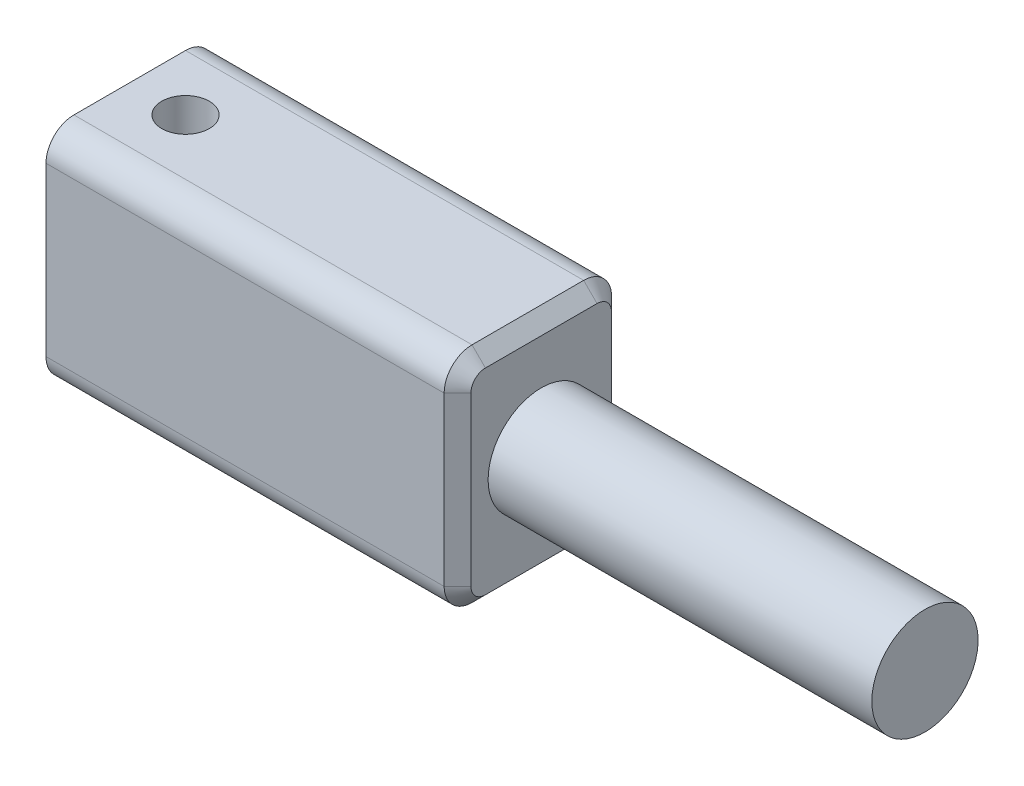
ISO-10303-21;
HEADER;
FILE_DESCRIPTION(('STEP AP214'),'2;1');
FILE_NAME('part.step','',(''),(''),'','','');
FILE_SCHEMA(('AUTOMOTIVE_DESIGN { 1 0 10303 214 1 1 1 1 }'));
ENDSEC;
DATA;
#1=APPLICATION_CONTEXT('core data for automotive mechanical design processes');
#2=APPLICATION_PROTOCOL_DEFINITION('international standard','automotive_design',2000,#1);
#3=PRODUCT_CONTEXT('',#1,'mechanical');
#4=PRODUCT('Part','Part','',(#3));
#5=PRODUCT_RELATED_PRODUCT_CATEGORY('part','',(#4));
#6=PRODUCT_DEFINITION_FORMATION('','',#4);
#7=PRODUCT_DEFINITION_CONTEXT('part definition',#1,'design');
#8=PRODUCT_DEFINITION('design','',#6,#7);
#9=PRODUCT_DEFINITION_SHAPE('','',#8);
#10=(LENGTH_UNIT() NAMED_UNIT(*) SI_UNIT(.MILLI.,.METRE.));
#11=(NAMED_UNIT(*) PLANE_ANGLE_UNIT() SI_UNIT($,.RADIAN.));
#12=(NAMED_UNIT(*) SI_UNIT($,.STERADIAN.) SOLID_ANGLE_UNIT());
#13=UNCERTAINTY_MEASURE_WITH_UNIT(LENGTH_MEASURE(1.E-05),#10,'distance_accuracy_value','');
#14=(GEOMETRIC_REPRESENTATION_CONTEXT(3) GLOBAL_UNCERTAINTY_ASSIGNED_CONTEXT((#13)) GLOBAL_UNIT_ASSIGNED_CONTEXT((#10,
#11,#12)) REPRESENTATION_CONTEXT('',''));
#15=CARTESIAN_POINT('',(0.,0.,0.));
#16=DIRECTION('',(0.,0.,1.));
#17=DIRECTION('',(1.,0.,0.));
#18=AXIS2_PLACEMENT_3D('',#15,#16,#17);
#19=CARTESIAN_POINT('',(39.28745,6.35,-4.7625));
#20=DIRECTION('',(0.,1.,0.));
#21=DIRECTION('',(0.,0.,1.));
#22=AXIS2_PLACEMENT_3D('',#19,#20,#21);
#23=PLANE('',#22);
#24=DIRECTION('',(-1.,0.,0.));
#25=VECTOR('',#24,1.);
#26=CARTESIAN_POINT('',(39.28745,6.35,3.175));
#27=LINE('',#26,#25);
#28=CARTESIAN_POINT('',(0.,6.35,3.175));
#29=VERTEX_POINT('',#28);
#30=CARTESIAN_POINT('',(22.65045,6.35,3.175));
#31=VERTEX_POINT('',#30);
#32=EDGE_CURVE('E491',#29,#31,#27,.F.);
#33=ORIENTED_EDGE('',*,*,#32,.T.);
#34=DIRECTION('',(0.,0.,-1.));
#35=VECTOR('',#34,1.);
#36=CARTESIAN_POINT('',(22.65045,6.35,-3.175));
#37=LINE('',#36,#35);
#38=CARTESIAN_POINT('',(22.65045,6.35,-3.175));
#39=VERTEX_POINT('',#38);
#40=EDGE_CURVE('E12',#31,#39,#37,.T.);
#41=ORIENTED_EDGE('',*,*,#40,.T.);
#42=DIRECTION('',(-1.,0.,0.));
#43=VECTOR('',#42,1.);
#44=CARTESIAN_POINT('',(39.28745,6.35,-3.175));
#45=LINE('',#44,#43);
#46=CARTESIAN_POINT('',(0.,6.35,-3.175));
#47=VERTEX_POINT('',#46);
#48=EDGE_CURVE('E493',#39,#47,#45,.T.);
#49=ORIENTED_EDGE('',*,*,#48,.T.);
#50=DIRECTION('',(0.,0.,-1.));
#51=VECTOR('',#50,1.);
#52=CARTESIAN_POINT('',(0.,6.35,-4.7625));
#53=LINE('',#52,#51);
#54=EDGE_CURVE('E454',#29,#47,#53,.T.);
#55=ORIENTED_EDGE('',*,*,#54,.F.);
#56=EDGE_LOOP('',(#33,#41,#49,#55));
#57=FACE_BOUND('',#56,.T.);
#58=CARTESIAN_POINT('',(3.175,6.35,0.));
#59=DIRECTION('',(0.,1.,0.));
#60=DIRECTION('',(0.,0.,1.));
#61=AXIS2_PLACEMENT_3D('',#58,#59,#60);
#62=CIRCLE('',#61,1.35255);
#63=CARTESIAN_POINT('',(3.175,6.35,1.35255));
#64=VERTEX_POINT('',#63);
#65=EDGE_CURVE('E568',#64,#64,#62,.T.);
#66=ORIENTED_EDGE('',*,*,#65,.F.);
#67=EDGE_LOOP('',(#66));
#68=FACE_BOUND('',#67,.T.);
#69=ADVANCED_FACE('F361',(#57,#68),#23,.T.);
#70=CARTESIAN_POINT('',(9.525,0.,0.));
#71=DIRECTION('',(-1.,0.,0.));
#72=DIRECTION('',(0.,0.,1.));
#73=AXIS2_PLACEMENT_3D('',#70,#71,#72);
#74=CYLINDRICAL_SURFACE('',#73,1.524);
#75=CARTESIAN_POINT('',(0.,0.,0.));
#76=DIRECTION('',(-1.,0.,0.));
#77=DIRECTION('',(0.,0.,1.));
#78=AXIS2_PLACEMENT_3D('',#75,#76,#77);
#79=CIRCLE('',#78,1.524);
#80=CARTESIAN_POINT('',(0.,0.,1.524));
#81=VERTEX_POINT('',#80);
#82=EDGE_CURVE('E663',#81,#81,#79,.T.);
#83=ORIENTED_EDGE('',*,*,#82,.T.);
#84=EDGE_LOOP('',(#83));
#85=FACE_BOUND('',#84,.T.);
#86=CARTESIAN_POINT('',(9.525,0.,0.));
#87=DIRECTION('',(-1.,0.,0.));
#88=DIRECTION('',(0.,0.,1.));
#89=AXIS2_PLACEMENT_3D('',#86,#87,#88);
#90=CIRCLE('',#89,1.524);
#91=CARTESIAN_POINT('',(9.525,0.,1.524));
#92=VERTEX_POINT('',#91);
#93=EDGE_CURVE('E469',#92,#92,#90,.T.);
#94=ORIENTED_EDGE('',*,*,#93,.F.);
#95=EDGE_LOOP('',(#94));
#96=FACE_BOUND('',#95,.T.);
#97=CARTESIAN_POINT('',(3.175,-0.702270957323452,1.35255));
#98=CARTESIAN_POINT('',(3.21707217968336,-0.702279979262497,1.35254717818324));
#99=CARTESIAN_POINT('',(3.2591643143721,-0.706141236265535,1.35056087661199));
#100=CARTESIAN_POINT('',(3.34184693441425,-0.720653947836462,1.3428680638871));
#101=CARTESIAN_POINT('',(3.38243196712902,-0.731327915477317,1.3371492168582));
#102=CARTESIAN_POINT('',(3.47957631490848,-0.763523860000407,1.31911937089296));
#103=CARTESIAN_POINT('',(3.53485012558653,-0.787779459464968,1.30498326977875));
#104=CARTESIAN_POINT('',(3.64094442790641,-0.841537752527547,1.27098829114154));
#105=CARTESIAN_POINT('',(3.69174649367795,-0.871060765628537,1.25110706036587));
#106=CARTESIAN_POINT('',(3.78085338917612,-0.926970786373431,1.21007746320126));
#107=CARTESIAN_POINT('',(3.81978213869841,-0.952992605080561,1.18977093749453));
#108=CARTESIAN_POINT('',(3.89523306169008,-1.00557944964072,1.14567324245321));
#109=CARTESIAN_POINT('',(3.93175381464058,-1.03214478422859,1.12188004246961));
#110=CARTESIAN_POINT('',(4.03772218242477,-1.11141960629747,1.04532115075714));
#111=CARTESIAN_POINT('',(4.10375714327414,-1.16382979548051,0.987292210958925));
#112=CARTESIAN_POINT('',(4.21080906979762,-1.2511587498098,0.872411103540684));
#113=CARTESIAN_POINT('',(4.25404882712305,-1.28728225322205,0.818528346752338));
#114=CARTESIAN_POINT('',(4.33294448831643,-1.35409562655333,0.702467042033983));
#115=CARTESIAN_POINT('',(4.36861337122796,-1.38479478025334,0.640302993841241));
#116=CARTESIAN_POINT('',(4.42456600797019,-1.43333461068743,0.521004660290256));
#117=CARTESIAN_POINT('',(4.44648803820053,-1.45251193129574,0.465187769180202));
#118=CARTESIAN_POINT('',(4.48302451531313,-1.48459940546605,0.349478423927672));
#119=CARTESIAN_POINT('',(4.4976433200318,-1.49751329628366,0.289588424509329));
#120=CARTESIAN_POINT('',(4.51866145662187,-1.5161089677639,0.166903556635082));
#121=CARTESIAN_POINT('',(4.52501436302095,-1.52174989820533,0.104094315594963));
#122=CARTESIAN_POINT('',(4.52883977769142,-1.52514445578943,-0.0220041355046523));
#123=CARTESIAN_POINT('',(4.52631460610187,-1.52290014361013,-0.0852932158525667));
#124=CARTESIAN_POINT('',(4.51323018247251,-1.51130303702087,-0.204441240571813));
#125=CARTESIAN_POINT('',(4.5034229544322,-1.50261571002647,-0.260452224794975));
#126=CARTESIAN_POINT('',(4.47726068872912,-1.47953693873412,-0.369682348683285));
#127=CARTESIAN_POINT('',(4.46090401488295,-1.46514406908574,-0.422900786953862));
#128=CARTESIAN_POINT('',(4.4212725144013,-1.43048290746596,-0.528760852731155));
#129=CARTESIAN_POINT('',(4.39763164437999,-1.40990567138485,-0.581162156614216));
#130=CARTESIAN_POINT('',(4.34491879370703,-1.36444751224133,-0.681085210018799));
#131=CARTESIAN_POINT('',(4.31584569876128,-1.33956570627468,-0.728605955302902));
#132=CARTESIAN_POINT('',(4.23676721794219,-1.27274377861347,-0.842025451480227));
#133=CARTESIAN_POINT('',(4.18375404315887,-1.22867618797298,-0.904579116775021));
#134=CARTESIAN_POINT('',(4.06909452295249,-1.13639682691843,-1.0181100655927));
#135=CARTESIAN_POINT('',(4.00740910463329,-1.0881667045469,-1.06903205444617));
#136=CARTESIAN_POINT('',(3.90832153448637,-1.01510729575818,-1.13722597152992));
#137=CARTESIAN_POINT('',(3.87375220166363,-0.990339529947954,-1.15879547172421));
#138=CARTESIAN_POINT('',(3.80244417231138,-0.941378567028568,-1.19890874898346));
#139=CARTESIAN_POINT('',(3.76570380499716,-0.917185833068511,-1.21745015327655));
#140=CARTESIAN_POINT('',(3.69008436595362,-0.870411845890656,-1.25131443016785));
#141=CARTESIAN_POINT('',(3.65121752518315,-0.847822804532961,-1.26665367715588));
#142=CARTESIAN_POINT('',(3.57090820653243,-0.805459169212386,-1.2940030210235));
#143=CARTESIAN_POINT('',(3.52947082334065,-0.785679248590163,-1.30601946074904));
#144=CARTESIAN_POINT('',(3.45022121831267,-0.75354551810751,-1.32477883385933));
#145=CARTESIAN_POINT('',(3.41281487347676,-0.740520008441139,-1.33204562784078));
#146=CARTESIAN_POINT('',(3.33619456686584,-0.719598636268923,-1.34346507565195));
#147=CARTESIAN_POINT('',(3.2969870537631,-0.711685800898481,-1.34762804061677));
#148=CARTESIAN_POINT('',(3.21710797519513,-0.702409401308774,-1.35249026637018));
#149=CARTESIAN_POINT('',(3.17642523200408,-0.701116833495169,-1.35315198189233));
#150=CARTESIAN_POINT('',(3.09553088696961,-0.705591670023033,-1.35082197843788));
#151=CARTESIAN_POINT('',(3.0553200575734,-0.71136935906665,-1.34782493729041));
#152=CARTESIAN_POINT('',(2.96792599485148,-0.730653206610229,-1.33748273346956));
#153=CARTESIAN_POINT('',(2.92117236186777,-0.745588304634533,-1.32932118208931));
#154=CARTESIAN_POINT('',(2.83073217898877,-0.780994820452487,-1.30883118995821));
#155=CARTESIAN_POINT('',(2.78705800023929,-0.801487125720679,-1.29648698358507));
#156=CARTESIAN_POINT('',(2.70657947746851,-0.843530277280837,-1.26948792522576));
#157=CARTESIAN_POINT('',(2.66951485821868,-0.864802087293333,-1.25515789758804));
#158=CARTESIAN_POINT('',(2.59748189898453,-0.908791447443696,-1.22368658903565));
#159=CARTESIAN_POINT('',(2.56251517718985,-0.931510086426917,-1.20654317516912));
#160=CARTESIAN_POINT('',(2.46039851996664,-1.00064820268408,-1.15098258898917));
#161=CARTESIAN_POINT('',(2.39608199798879,-1.04802113948181,-1.1084522840693));
#162=CARTESIAN_POINT('',(2.27070372804145,-1.14422575019542,-1.0091837203809));
#163=CARTESIAN_POINT('',(2.21015767539551,-1.19293882226644,-0.951678112407259));
#164=CARTESIAN_POINT('',(2.09902154373213,-1.28449682649553,-0.823882868449129));
#165=CARTESIAN_POINT('',(2.04840177038203,-1.32735914047292,-0.753632610525875));
#166=CARTESIAN_POINT('',(1.97407854020015,-1.39110139465381,-0.625138330755869));
#167=CARTESIAN_POINT('',(1.94693733014504,-1.41463456160875,-0.570197342077547));
#168=CARTESIAN_POINT('',(1.89983630684233,-1.45571040309329,-0.455192241264111));
#169=CARTESIAN_POINT('',(1.87987167295367,-1.47325709844374,-0.395131601769294));
#170=CARTESIAN_POINT('',(1.84825012351509,-1.50113078852859,-0.270691843317126));
#171=CARTESIAN_POINT('',(1.83665787260538,-1.51140157591453,-0.206283225701143));
#172=CARTESIAN_POINT('',(1.82297811137812,-1.52352783509803,-0.0756874888437563));
#173=CARTESIAN_POINT('',(1.82088452196937,-1.52538868920375,-0.00950153438310301));
#174=CARTESIAN_POINT('',(1.8260402528428,-1.52081442502809,0.114416735355444));
#175=CARTESIAN_POINT('',(1.83222731326676,-1.51532250764779,0.172233851767758));
#176=CARTESIAN_POINT('',(1.85171165075638,-1.4980841090639,0.285679418145234));
#177=CARTESIAN_POINT('',(1.86500979574868,-1.48633686438186,0.341307600055206));
#178=CARTESIAN_POINT('',(1.89819349259866,-1.45717382833434,0.44992535727258));
#179=CARTESIAN_POINT('',(1.91817426416168,-1.43967616673655,0.502863253682306));
#180=CARTESIAN_POINT('',(1.96372547923972,-1.40008735638288,0.604406875098513));
#181=CARTESIAN_POINT('',(1.98929839165491,-1.37799417894228,0.653010673238715));
#182=CARTESIAN_POINT('',(2.05865277909166,-1.31869140295251,0.76784024535857));
#183=CARTESIAN_POINT('',(2.10526627176798,-1.27933163768512,0.831252992794772));
#184=CARTESIAN_POINT('',(2.20672301106169,-1.19578970513987,0.94753267865525));
#185=CARTESIAN_POINT('',(2.26158852232377,-1.15159458238565,1.00037015658202));
#186=CARTESIAN_POINT('',(2.3796383931867,-1.06033696777279,1.0966905635919));
#187=CARTESIAN_POINT('',(2.44297795272761,-1.01323298272958,1.139944603812));
#188=CARTESIAN_POINT('',(2.54349555096642,-0.944142696962623,1.19668945693576));
#189=CARTESIAN_POINT('',(2.57790705707033,-0.921380886359577,1.21424387045927));
#190=CARTESIAN_POINT('',(2.64876636319789,-0.87711865651036,1.24659001415373));
#191=CARTESIAN_POINT('',(2.68521266158619,-0.855617330460224,1.26138374753475));
#192=CARTESIAN_POINT('',(2.76272124728248,-0.813651054483193,1.28888076750124));
#193=CARTESIAN_POINT('',(2.80392956253207,-0.793330991337368,1.30139972257987));
#194=CARTESIAN_POINT('',(2.88917980052923,-0.757231243757115,1.32273075371325));
#195=CARTESIAN_POINT('',(2.93321346873306,-0.741439009371421,1.33155310775882));
#196=CARTESIAN_POINT('',(3.01037129337357,-0.720661433028069,1.34287789414377));
#197=CARTESIAN_POINT('',(3.04283129557991,-0.713857614010815,1.34648053559675));
#198=CARTESIAN_POINT('',(3.10852414729912,-0.704661911686318,1.35131603825143));
#199=CARTESIAN_POINT('',(3.14175584401672,-0.702263828461787,1.35255222971372));
#200=CARTESIAN_POINT('',(3.175,-0.702270957323452,1.35255));
#201=B_SPLINE_CURVE_WITH_KNOTS('',3,(#97,#98,#99,#100,#101,#102,#103,#104,#105,#106,#107,#108,
#109,#110,#111,#112,#113,#114,#115,#116,#117,#118,#119,#120,#121,#122,#123,#124,#125,#126,#127,
#128,#129,#130,#131,#132,#133,#134,#135,#136,#137,#138,#139,#140,#141,#142,#143,#144,#145,#146,
#147,#148,#149,#150,#151,#152,#153,#154,#155,#156,#157,#158,#159,#160,#161,#162,#163,#164,#165,
#166,#167,#168,#169,#170,#171,#172,#173,#174,#175,#176,#177,#178,#179,#180,#181,#182,#183,#184,
#185,#186,#187,#188,#189,#190,#191,#192,#193,#194,#195,#196,#197,#198,#199,#200),.UNSPECIFIED.,
.T.,.F.,(4,2,2,2,2,2,2,2,2,2,2,2,2,2,2,2,2,2,2,2,2,2,2,2,2,2,2,2,2,2,2,2,2,2,2,2,2,2,2,2,2,2,2,
2,2,2,2,2,2,2,2,4),(0.,0.126063369193998,0.252545495709718,0.437479934952307,0.623143838396348,
0.776063927680587,0.929073434650462,1.23439828791887,1.46749024436466,1.70017931576062,
1.88829730084201,2.07630290140219,2.26535994238806,2.45436758011159,2.62617526171937,
2.79802589114982,2.98053101244574,3.16307361158685,3.44084358107695,3.71990773794989,
3.86284266811253,4.00588906812932,4.14818503530543,4.29020747117032,4.41064990338174,
4.53069041254542,4.65201559213964,4.77351746658282,4.92194493525667,5.07093821082692,
5.20597279661751,5.34111023507301,5.61156354361266,5.90033933011229,6.18823760822231,
6.38443434883885,6.58049905305646,6.77806233685239,6.97549916337932,7.14988497386687,
7.32429207346217,7.50129839279643,7.67838301781703,7.94091316310625,8.20416478347162,
8.47315188413674,8.60755574743725,8.74186170186414,8.88442113164787,9.02658151740235,
9.12633343769168,9.22594487548273),.UNSPECIFIED.);
#202=CARTESIAN_POINT('',(3.175,-0.702270957323452,1.35255));
#203=VERTEX_POINT('',#202);
#204=EDGE_CURVE('E666',#203,#203,#201,.T.);
#205=ORIENTED_EDGE('',*,*,#204,.F.);
#206=EDGE_LOOP('',(#205));
#207=FACE_BOUND('',#206,.T.);
#208=CARTESIAN_POINT('',(3.175,0.702270957323452,-1.35255));
#209=CARTESIAN_POINT('',(3.13292782031664,0.702279979262497,-1.35254717818324));
#210=CARTESIAN_POINT('',(3.09083568562791,0.706141236265535,-1.35056087661199));
#211=CARTESIAN_POINT('',(3.00815306558575,0.720653947836462,-1.3428680638871));
#212=CARTESIAN_POINT('',(2.96756803287098,0.731327915477317,-1.3371492168582));
#213=CARTESIAN_POINT('',(2.87042368509153,0.763523860000406,-1.31911937089296));
#214=CARTESIAN_POINT('',(2.81514987441348,0.787779459464967,-1.30498326977875));
#215=CARTESIAN_POINT('',(2.70905557209359,0.841537752527545,-1.27098829114155));
#216=CARTESIAN_POINT('',(2.65825350632205,0.871060765628536,-1.25110706036587));
#217=CARTESIAN_POINT('',(2.56914661082389,0.926970786373429,-1.21007746320126));
#218=CARTESIAN_POINT('',(2.5302178613016,0.952992605080559,-1.18977093749453));
#219=CARTESIAN_POINT('',(2.45476693830992,1.00557944964072,-1.14567324245321));
#220=CARTESIAN_POINT('',(2.41824618535943,1.03214478422859,-1.12188004246961));
#221=CARTESIAN_POINT('',(2.31227781757523,1.11141960629746,-1.04532115075715));
#222=CARTESIAN_POINT('',(2.24624285672587,1.1638297954805,-0.987292210958928));
#223=CARTESIAN_POINT('',(2.13919093020239,1.25115874980979,-0.872411103540687));
#224=CARTESIAN_POINT('',(2.09595117287696,1.28728225322204,-0.818528346752341));
#225=CARTESIAN_POINT('',(2.01705551168357,1.35409562655333,-0.702467042033986));
#226=CARTESIAN_POINT('',(1.98138662877205,1.38479478025334,-0.640302993841243));
#227=CARTESIAN_POINT('',(1.92543399202981,1.43333461068743,-0.521004660290258));
#228=CARTESIAN_POINT('',(1.90351196179947,1.45251193129574,-0.465187769180204));
#229=CARTESIAN_POINT('',(1.86697548468687,1.48459940546604,-0.349478423927675));
#230=CARTESIAN_POINT('',(1.8523566799682,1.49751329628366,-0.289588424509331));
#231=CARTESIAN_POINT('',(1.83133854337813,1.5161089677639,-0.166903556635084));
#232=CARTESIAN_POINT('',(1.82498563697905,1.52174989820533,-0.104094315594965));
#233=CARTESIAN_POINT('',(1.82116022230858,1.52514445578943,0.0220041355046508));
#234=CARTESIAN_POINT('',(1.82368539389813,1.52290014361013,0.0852932158525652));
#235=CARTESIAN_POINT('',(1.83676981752749,1.51130303702087,0.204441240571811));
#236=CARTESIAN_POINT('',(1.8465770455678,1.50261571002648,0.260452224794973));
#237=CARTESIAN_POINT('',(1.87273931127088,1.47953693873412,0.369682348683283));
#238=CARTESIAN_POINT('',(1.88909598511706,1.46514406908574,0.422900786953861));
#239=CARTESIAN_POINT('',(1.9287274855987,1.43048290746596,0.528760852731154));
#240=CARTESIAN_POINT('',(1.95236835562001,1.40990567138485,0.581162156614215));
#241=CARTESIAN_POINT('',(2.00508120629297,1.36444751224134,0.681085210018798));
#242=CARTESIAN_POINT('',(2.03415430123872,1.33956570627468,0.728605955302901));
#243=CARTESIAN_POINT('',(2.11323278205781,1.27274377861347,0.842025451480226));
#244=CARTESIAN_POINT('',(2.16624595684113,1.22867618797298,0.90457911677502));
#245=CARTESIAN_POINT('',(2.28090547704751,1.13639682691844,1.0181100655927));
#246=CARTESIAN_POINT('',(2.34259089536671,1.0881667045469,1.06903205444617));
#247=CARTESIAN_POINT('',(2.44167846551363,1.01510729575818,1.13722597152992));
#248=CARTESIAN_POINT('',(2.47624779833637,0.990339529947954,1.15879547172421));
#249=CARTESIAN_POINT('',(2.54755582768862,0.941378567028568,1.19890874898346));
#250=CARTESIAN_POINT('',(2.58429619500284,0.917185833068512,1.21745015327655));
#251=CARTESIAN_POINT('',(2.65991563404638,0.870411845890657,1.25131443016785));
#252=CARTESIAN_POINT('',(2.69878247481685,0.847822804532962,1.26665367715588));
#253=CARTESIAN_POINT('',(2.77909179346757,0.805459169212386,1.29400302102349));
#254=CARTESIAN_POINT('',(2.82052917665935,0.785679248590163,1.30601946074904));
#255=CARTESIAN_POINT('',(2.89977878168733,0.75354551810751,1.32477883385933));
#256=CARTESIAN_POINT('',(2.93718512652324,0.74052000844114,1.33204562784078));
#257=CARTESIAN_POINT('',(3.01380543313416,0.719598636268924,1.34346507565195));
#258=CARTESIAN_POINT('',(3.0530129462369,0.711685800898481,1.34762804061677));
#259=CARTESIAN_POINT('',(3.13289202480486,0.702409401308774,1.35249026637018));
#260=CARTESIAN_POINT('',(3.17357476799592,0.701116833495169,1.35315198189233));
#261=CARTESIAN_POINT('',(3.25446911303039,0.705591670023033,1.35082197843788));
#262=CARTESIAN_POINT('',(3.2946799424266,0.711369359066649,1.34782493729041));
#263=CARTESIAN_POINT('',(3.38207400514852,0.730653206610228,1.33748273346957));
#264=CARTESIAN_POINT('',(3.42882763813223,0.745588304634532,1.32932118208931));
#265=CARTESIAN_POINT('',(3.51926782101123,0.780994820452486,1.30883118995821));
#266=CARTESIAN_POINT('',(3.56294199976071,0.801487125720678,1.29648698358507));
#267=CARTESIAN_POINT('',(3.64342052253149,0.843530277280835,1.26948792522577));
#268=CARTESIAN_POINT('',(3.68048514178132,0.864802087293331,1.25515789758804));
#269=CARTESIAN_POINT('',(3.75251810101547,0.908791447443695,1.22368658903565));
#270=CARTESIAN_POINT('',(3.78748482281015,0.931510086426917,1.20654317516912));
#271=CARTESIAN_POINT('',(3.88960148003336,1.00064820268408,1.15098258898917));
#272=CARTESIAN_POINT('',(3.95391800201121,1.04802113948181,1.1084522840693));
#273=CARTESIAN_POINT('',(4.07929627195855,1.14422575019542,1.0091837203809));
#274=CARTESIAN_POINT('',(4.13984232460449,1.19293882226644,0.951678112407258));
#275=CARTESIAN_POINT('',(4.25097845626788,1.28449682649553,0.823882868449127));
#276=CARTESIAN_POINT('',(4.30159822961797,1.32735914047292,0.753632610525872));
#277=CARTESIAN_POINT('',(4.37592145979985,1.39110139465382,0.625138330755867));
#278=CARTESIAN_POINT('',(4.40306266985496,1.41463456160875,0.570197342077545));
#279=CARTESIAN_POINT('',(4.45016369315767,1.4557104030933,0.455192241264108));
#280=CARTESIAN_POINT('',(4.47012832704634,1.47325709844374,0.395131601769292));
#281=CARTESIAN_POINT('',(4.50174987648491,1.50113078852859,0.270691843317123));
#282=CARTESIAN_POINT('',(4.51334212739462,1.51140157591453,0.206283225701141));
#283=CARTESIAN_POINT('',(4.52702188862188,1.52352783509803,0.0756874888437545));
#284=CARTESIAN_POINT('',(4.52911547803063,1.52538868920375,0.00950153438310112));
#285=CARTESIAN_POINT('',(4.5239597471572,1.52081442502809,-0.114416735355446));
#286=CARTESIAN_POINT('',(4.51777268673324,1.51532250764779,-0.17223385176776));
#287=CARTESIAN_POINT('',(4.49828834924362,1.4980841090639,-0.285679418145236));
#288=CARTESIAN_POINT('',(4.48499020425132,1.48633686438186,-0.341307600055208));
#289=CARTESIAN_POINT('',(4.45180650740135,1.45717382833434,-0.449925357272581));
#290=CARTESIAN_POINT('',(4.43182573583832,1.43967616673655,-0.502863253682307));
#291=CARTESIAN_POINT('',(4.38627452076028,1.40008735638288,-0.604406875098515));
#292=CARTESIAN_POINT('',(4.36070160834509,1.37799417894228,-0.653010673238716));
#293=CARTESIAN_POINT('',(4.29134722090834,1.31869140295251,-0.76784024535857));
#294=CARTESIAN_POINT('',(4.24473372823202,1.27933163768512,-0.831252992794773));
#295=CARTESIAN_POINT('',(4.14327698893831,1.19578970513987,-0.947532678655251));
#296=CARTESIAN_POINT('',(4.08841147767623,1.15159458238565,-1.00037015658202));
#297=CARTESIAN_POINT('',(3.9703616068133,1.06033696777279,-1.0966905635919));
#298=CARTESIAN_POINT('',(3.90702204727239,1.01323298272958,-1.139944603812));
#299=CARTESIAN_POINT('',(3.80650444903359,0.944142696962624,-1.19668945693576));
#300=CARTESIAN_POINT('',(3.77209294292968,0.921380886359578,-1.21424387045927));
#301=CARTESIAN_POINT('',(3.70123363680212,0.87711865651036,-1.24659001415372));
#302=CARTESIAN_POINT('',(3.66478733841381,0.855617330460224,-1.26138374753475));
#303=CARTESIAN_POINT('',(3.58727875271752,0.813651054483192,-1.28888076750124));
#304=CARTESIAN_POINT('',(3.54607043746793,0.793330991337368,-1.30139972257987));
#305=CARTESIAN_POINT('',(3.46082019947077,0.757231243757114,-1.32273075371325));
#306=CARTESIAN_POINT('',(3.41678653126694,0.741439009371421,-1.33155310775882));
#307=CARTESIAN_POINT('',(3.33962870662643,0.720661433028069,-1.34287789414377));
#308=CARTESIAN_POINT('',(3.30716870442009,0.713857614010815,-1.34648053559675));
#309=CARTESIAN_POINT('',(3.24147585270088,0.704661911686318,-1.35131603825143));
#310=CARTESIAN_POINT('',(3.20824415598328,0.702263828461787,-1.35255222971372));
#311=CARTESIAN_POINT('',(3.175,0.702270957323452,-1.35255));
#312=B_SPLINE_CURVE_WITH_KNOTS('',3,(#208,#209,#210,#211,#212,#213,#214,#215,#216,#217,#218,
#219,#220,#221,#222,#223,#224,#225,#226,#227,#228,#229,#230,#231,#232,#233,#234,#235,#236,#237,
#238,#239,#240,#241,#242,#243,#244,#245,#246,#247,#248,#249,#250,#251,#252,#253,#254,#255,#256,
#257,#258,#259,#260,#261,#262,#263,#264,#265,#266,#267,#268,#269,#270,#271,#272,#273,#274,#275,
#276,#277,#278,#279,#280,#281,#282,#283,#284,#285,#286,#287,#288,#289,#290,#291,#292,#293,#294,
#295,#296,#297,#298,#299,#300,#301,#302,#303,#304,#305,#306,#307,#308,#309,#310,#311),
.UNSPECIFIED.,.T.,.F.,(4,2,2,2,2,2,2,2,2,2,2,2,2,2,2,2,2,2,2,2,2,2,2,2,2,2,2,2,2,2,2,2,2,2,2,2,
2,2,2,2,2,2,2,2,2,2,2,2,2,2,2,4),(0.,0.126063369193998,0.252545495709717,0.437479934952305,
0.623143838396345,0.776063927680584,0.929073434650458,1.23439828791887,1.46749024436466,
1.70017931576062,1.88829730084201,2.07630290140219,2.26535994238806,2.45436758011159,
2.62617526171937,2.79802589114982,2.98053101244574,3.16307361158685,3.44084358107695,
3.71990773794989,3.86284266811252,4.00588906812931,4.14818503530542,4.29020747117032,
4.41064990338174,4.53069041254541,4.65201559213964,4.77351746658282,4.92194493525667,
5.07093821082692,5.20597279661751,5.34111023507301,5.61156354361265,5.90033933011229,
6.18823760822231,6.38443434883885,6.58049905305646,6.77806233685239,6.97549916337932,
7.14988497386687,7.32429207346217,7.50129839279643,7.67838301781703,7.94091316310625,
8.20416478347162,8.47315188413674,8.60755574743725,8.74186170186414,8.88442113164787,
9.02658151740235,9.12633343769168,9.22594487548273),.UNSPECIFIED.);
#313=CARTESIAN_POINT('',(3.175,0.702270957323452,-1.35255));
#314=VERTEX_POINT('',#313);
#315=EDGE_CURVE('E561',#314,#314,#312,.T.);
#316=ORIENTED_EDGE('',*,*,#315,.T.);
#317=EDGE_LOOP('',(#316));
#318=FACE_BOUND('',#317,.T.);
#319=ADVANCED_FACE('F617',(#85,#96,#207,#318),#74,.F.);
#320=CARTESIAN_POINT('',(23.41245,4.7625,0.));
#321=DIRECTION('',(-1.,0.,0.));
#322=DIRECTION('',(0.,0.,1.));
#323=AXIS2_PLACEMENT_3D('',#320,#321,#322);
#324=PLANE('',#323);
#325=CARTESIAN_POINT('',(23.41245,-4.7625,3.175));
#326=DIRECTION('',(-1.,0.,0.));
#327=DIRECTION('',(0.,0.,1.));
#328=AXIS2_PLACEMENT_3D('',#325,#326,#327);
#329=CIRCLE('',#328,0.825500000000002);
#330=CARTESIAN_POINT('',(23.41245,-4.7625,4.0005));
#331=VERTEX_POINT('',#330);
#332=CARTESIAN_POINT('',(23.41245,-5.588,3.175));
#333=VERTEX_POINT('',#332);
#334=EDGE_CURVE('E510',#331,#333,#329,.F.);
#335=ORIENTED_EDGE('',*,*,#334,.T.);
#336=DIRECTION('',(0.,0.,-1.));
#337=VECTOR('',#336,1.);
#338=CARTESIAN_POINT('',(23.41245,-5.588,-3.175));
#339=LINE('',#338,#337);
#340=CARTESIAN_POINT('',(23.41245,-5.588,-3.175));
#341=VERTEX_POINT('',#340);
#342=EDGE_CURVE('E514',#333,#341,#339,.T.);
#343=ORIENTED_EDGE('',*,*,#342,.T.);
#344=CARTESIAN_POINT('',(23.41245,-4.7625,-3.175));
#345=DIRECTION('',(-1.,0.,0.));
#346=DIRECTION('',(0.,0.,1.));
#347=AXIS2_PLACEMENT_3D('',#344,#345,#346);
#348=CIRCLE('',#347,0.825500000000001);
#349=CARTESIAN_POINT('',(23.41245,-4.7625,-4.0005));
#350=VERTEX_POINT('',#349);
#351=EDGE_CURVE('E512',#341,#350,#348,.F.);
#352=ORIENTED_EDGE('',*,*,#351,.T.);
#353=DIRECTION('',(0.,1.,0.));
#354=VECTOR('',#353,1.);
#355=CARTESIAN_POINT('',(23.41245,4.7625,-4.0005));
#356=LINE('',#355,#354);
#357=CARTESIAN_POINT('',(23.41245,4.7625,-4.0005));
#358=VERTEX_POINT('',#357);
#359=EDGE_CURVE('E508',#350,#358,#356,.T.);
#360=ORIENTED_EDGE('',*,*,#359,.T.);
#361=CARTESIAN_POINT('',(23.41245,4.7625,-3.175));
#362=DIRECTION('',(-1.,0.,0.));
#363=DIRECTION('',(0.,0.,1.));
#364=AXIS2_PLACEMENT_3D('',#361,#362,#363);
#365=CIRCLE('',#364,0.825500000000002);
#366=CARTESIAN_POINT('',(23.41245,5.588,-3.175));
#367=VERTEX_POINT('',#366);
#368=EDGE_CURVE('E504',#358,#367,#365,.F.);
#369=ORIENTED_EDGE('',*,*,#368,.T.);
#370=DIRECTION('',(0.,0.,1.));
#371=VECTOR('',#370,1.);
#372=CARTESIAN_POINT('',(23.41245,5.588,3.175));
#373=LINE('',#372,#371);
#374=CARTESIAN_POINT('',(23.41245,5.588,3.175));
#375=VERTEX_POINT('',#374);
#376=EDGE_CURVE('E500',#367,#375,#373,.T.);
#377=ORIENTED_EDGE('',*,*,#376,.T.);
#378=CARTESIAN_POINT('',(23.41245,4.7625,3.175));
#379=DIRECTION('',(-1.,0.,0.));
#380=DIRECTION('',(0.,0.,1.));
#381=AXIS2_PLACEMENT_3D('',#378,#379,#380);
#382=CIRCLE('',#381,0.825500000000001);
#383=CARTESIAN_POINT('',(23.41245,4.7625,4.0005));
#384=VERTEX_POINT('',#383);
#385=EDGE_CURVE('E502',#375,#384,#382,.F.);
#386=ORIENTED_EDGE('',*,*,#385,.T.);
#387=DIRECTION('',(0.,-1.,0.));
#388=VECTOR('',#387,1.);
#389=CARTESIAN_POINT('',(23.41245,-4.7625,4.0005));
#390=LINE('',#389,#388);
#391=EDGE_CURVE('E506',#384,#331,#390,.T.);
#392=ORIENTED_EDGE('',*,*,#391,.T.);
#393=EDGE_LOOP('',(#335,#343,#352,#360,#369,#377,#386,#392));
#394=FACE_BOUND('',#393,.T.);
#395=CARTESIAN_POINT('',(23.41245,0.,0.));
#396=DIRECTION('',(-1.,0.,0.));
#397=DIRECTION('',(0.,0.,1.));
#398=AXIS2_PLACEMENT_3D('',#395,#396,#397);
#399=CIRCLE('',#398,3.0226);
#400=CARTESIAN_POINT('',(23.41245,0.,3.0226));
#401=VERTEX_POINT('',#400);
#402=EDGE_CURVE('E474',#401,#401,#399,.T.);
#403=ORIENTED_EDGE('',*,*,#402,.T.);
#404=EDGE_LOOP('',(#403));
#405=FACE_BOUND('',#404,.T.);
#406=ADVANCED_FACE('F624',(#394,#405),#324,.F.);
#407=CARTESIAN_POINT('',(0.,0.,0.));
#408=DIRECTION('',(-1.,0.,0.));
#409=DIRECTION('',(0.,0.,1.));
#410=AXIS2_PLACEMENT_3D('',#407,#408,#409);
#411=CYLINDRICAL_SURFACE('',#410,3.0226);
#412=ORIENTED_EDGE('',*,*,#402,.F.);
#413=EDGE_LOOP('',(#412));
#414=FACE_BOUND('',#413,.T.);
#415=CARTESIAN_POINT('',(45.24375,0.,0.));
#416=DIRECTION('',(-1.,0.,0.));
#417=DIRECTION('',(0.,0.,1.));
#418=AXIS2_PLACEMENT_3D('',#415,#416,#417);
#419=CIRCLE('',#418,3.0226);
#420=CARTESIAN_POINT('',(45.24375,0.,3.0226));
#421=VERTEX_POINT('',#420);
#422=EDGE_CURVE('E479',#421,#421,#419,.T.);
#423=ORIENTED_EDGE('',*,*,#422,.T.);
#424=EDGE_LOOP('',(#423));
#425=FACE_BOUND('',#424,.T.);
#426=ADVANCED_FACE('F641',(#414,#425),#411,.T.);
#427=CARTESIAN_POINT('',(45.24375,3.0226,0.));
#428=DIRECTION('',(-1.,0.,0.));
#429=DIRECTION('',(0.,0.,1.));
#430=AXIS2_PLACEMENT_3D('',#427,#428,#429);
#431=PLANE('',#430);
#432=ORIENTED_EDGE('',*,*,#422,.F.);
#433=EDGE_LOOP('',(#432));
#434=FACE_BOUND('',#433,.T.);
#435=ADVANCED_FACE('F638',(#434),#431,.F.);
#436=CARTESIAN_POINT('',(39.28745,-6.35,-4.7625));
#437=DIRECTION('',(0.,0.,-1.));
#438=DIRECTION('',(-1.,0.,0.));
#439=AXIS2_PLACEMENT_3D('',#436,#437,#438);
#440=PLANE('',#439);
#441=DIRECTION('',(-1.,0.,0.));
#442=VECTOR('',#441,1.);
#443=CARTESIAN_POINT('',(39.28745,4.7625,-4.7625));
#444=LINE('',#443,#442);
#445=CARTESIAN_POINT('',(0.,4.7625,-4.7625));
#446=VERTEX_POINT('',#445);
#447=CARTESIAN_POINT('',(22.65045,4.7625,-4.7625));
#448=VERTEX_POINT('',#447);
#449=EDGE_CURVE('E463',#446,#448,#444,.F.);
#450=ORIENTED_EDGE('',*,*,#449,.T.);
#451=DIRECTION('',(0.,-1.,0.));
#452=VECTOR('',#451,1.);
#453=CARTESIAN_POINT('',(22.65045,-4.7625,-4.7625));
#454=LINE('',#453,#452);
#455=CARTESIAN_POINT('',(22.65045,-4.7625,-4.7625));
#456=VERTEX_POINT('',#455);
#457=EDGE_CURVE('E524',#448,#456,#454,.T.);
#458=ORIENTED_EDGE('',*,*,#457,.T.);
#459=DIRECTION('',(-1.,0.,0.));
#460=VECTOR('',#459,1.);
#461=CARTESIAN_POINT('',(39.28745,-4.7625,-4.7625));
#462=LINE('',#461,#460);
#463=CARTESIAN_POINT('',(0.,-4.7625,-4.7625));
#464=VERTEX_POINT('',#463);
#465=EDGE_CURVE('E466',#456,#464,#462,.T.);
#466=ORIENTED_EDGE('',*,*,#465,.T.);
#467=DIRECTION('',(0.,-1.,0.));
#468=VECTOR('',#467,1.);
#469=CARTESIAN_POINT('',(0.,-6.35,-4.7625));
#470=LINE('',#469,#468);
#471=EDGE_CURVE('E452',#446,#464,#470,.T.);
#472=ORIENTED_EDGE('',*,*,#471,.F.);
#473=EDGE_LOOP('',(#450,#458,#466,#472));
#474=FACE_BOUND('',#473,.T.);
#475=ADVANCED_FACE('F462',(#474),#440,.T.);
#476=CARTESIAN_POINT('',(39.28745,-6.35,4.7625));
#477=DIRECTION('',(0.,0.,1.));
#478=DIRECTION('',(1.,0.,0.));
#479=AXIS2_PLACEMENT_3D('',#476,#477,#478);
#480=PLANE('',#479);
#481=DIRECTION('',(-1.,0.,0.));
#482=VECTOR('',#481,1.);
#483=CARTESIAN_POINT('',(39.28745,-4.7625,4.7625));
#484=LINE('',#483,#482);
#485=CARTESIAN_POINT('',(0.,-4.7625,4.7625));
#486=VERTEX_POINT('',#485);
#487=CARTESIAN_POINT('',(22.65045,-4.7625,4.7625));
#488=VERTEX_POINT('',#487);
#489=EDGE_CURVE('E495',#486,#488,#484,.F.);
#490=ORIENTED_EDGE('',*,*,#489,.T.);
#491=DIRECTION('',(0.,1.,0.));
#492=VECTOR('',#491,1.);
#493=CARTESIAN_POINT('',(22.65045,4.7625,4.7625));
#494=LINE('',#493,#492);
#495=CARTESIAN_POINT('',(22.65045,4.7625,4.7625));
#496=VERTEX_POINT('',#495);
#497=EDGE_CURVE('E526',#488,#496,#494,.T.);
#498=ORIENTED_EDGE('',*,*,#497,.T.);
#499=DIRECTION('',(-1.,0.,0.));
#500=VECTOR('',#499,1.);
#501=CARTESIAN_POINT('',(39.28745,4.7625,4.7625));
#502=LINE('',#501,#500);
#503=CARTESIAN_POINT('',(0.,4.7625,4.7625));
#504=VERTEX_POINT('',#503);
#505=EDGE_CURVE('E498',#496,#504,#502,.T.);
#506=ORIENTED_EDGE('',*,*,#505,.T.);
#507=DIRECTION('',(0.,1.,0.));
#508=VECTOR('',#507,1.);
#509=CARTESIAN_POINT('',(0.,-6.35,4.7625));
#510=LINE('',#509,#508);
#511=EDGE_CURVE('E655',#486,#504,#510,.T.);
#512=ORIENTED_EDGE('',*,*,#511,.F.);
#513=EDGE_LOOP('',(#490,#498,#506,#512));
#514=FACE_BOUND('',#513,.T.);
#515=ADVANCED_FACE('F530',(#514),#480,.T.);
#516=CARTESIAN_POINT('',(39.28745,-6.35,-4.7625));
#517=DIRECTION('',(0.,-1.,0.));
#518=DIRECTION('',(0.,0.,-1.));
#519=AXIS2_PLACEMENT_3D('',#516,#517,#518);
#520=PLANE('',#519);
#521=CARTESIAN_POINT('',(3.175,-6.35,0.));
#522=DIRECTION('',(0.,-1.,0.));
#523=DIRECTION('',(0.,0.,-1.));
#524=AXIS2_PLACEMENT_3D('',#521,#522,#523);
#525=CIRCLE('',#524,1.35255);
#526=CARTESIAN_POINT('',(3.175,-6.35,-1.35255));
#527=VERTEX_POINT('',#526);
#528=EDGE_CURVE('E667',#527,#527,#525,.F.);
#529=ORIENTED_EDGE('',*,*,#528,.T.);
#530=EDGE_LOOP('',(#529));
#531=FACE_BOUND('',#530,.T.);
#532=DIRECTION('',(-1.,0.,0.));
#533=VECTOR('',#532,1.);
#534=CARTESIAN_POINT('',(39.28745,-6.35,-3.175));
#535=LINE('',#534,#533);
#536=CARTESIAN_POINT('',(0.,-6.35,-3.175));
#537=VERTEX_POINT('',#536);
#538=CARTESIAN_POINT('',(22.65045,-6.35,-3.175));
#539=VERTEX_POINT('',#538);
#540=EDGE_CURVE('E488',#537,#539,#535,.F.);
#541=ORIENTED_EDGE('',*,*,#540,.T.);
#542=DIRECTION('',(0.,0.,1.));
#543=VECTOR('',#542,1.);
#544=CARTESIAN_POINT('',(22.65045,-6.35,3.175));
#545=LINE('',#544,#543);
#546=CARTESIAN_POINT('',(22.65045,-6.35,3.175));
#547=VERTEX_POINT('',#546);
#548=EDGE_CURVE('E517',#539,#547,#545,.T.);
#549=ORIENTED_EDGE('',*,*,#548,.T.);
#550=DIRECTION('',(-1.,0.,0.));
#551=VECTOR('',#550,1.);
#552=CARTESIAN_POINT('',(39.28745,-6.35,3.175));
#553=LINE('',#552,#551);
#554=CARTESIAN_POINT('',(0.,-6.35,3.175));
#555=VERTEX_POINT('',#554);
#556=EDGE_CURVE('E486',#547,#555,#553,.T.);
#557=ORIENTED_EDGE('',*,*,#556,.T.);
#558=DIRECTION('',(0.,0.,1.));
#559=VECTOR('',#558,1.);
#560=CARTESIAN_POINT('',(0.,-6.35,-4.7625));
#561=LINE('',#560,#559);
#562=EDGE_CURVE('E468',#537,#555,#561,.T.);
#563=ORIENTED_EDGE('',*,*,#562,.F.);
#564=EDGE_LOOP('',(#541,#549,#557,#563));
#565=FACE_BOUND('',#564,.T.);
#566=ADVANCED_FACE('F632',(#531,#565),#520,.T.);
#567=CARTESIAN_POINT('',(0.,0.,0.));
#568=DIRECTION('',(1.,0.,0.));
#569=DIRECTION('',(0.,0.,-1.));
#570=AXIS2_PLACEMENT_3D('',#567,#568,#569);
#571=PLANE('',#570);
#572=ORIENTED_EDGE('',*,*,#82,.F.);
#573=EDGE_LOOP('',(#572));
#574=FACE_BOUND('',#573,.T.);
#575=ORIENTED_EDGE('',*,*,#471,.T.);
#576=CARTESIAN_POINT('',(0.,-4.7625,-3.175));
#577=DIRECTION('',(1.,0.,0.));
#578=DIRECTION('',(0.,0.,-1.));
#579=AXIS2_PLACEMENT_3D('',#576,#577,#578);
#580=CIRCLE('',#579,1.5875);
#581=EDGE_CURVE('E457',#464,#537,#580,.F.);
#582=ORIENTED_EDGE('',*,*,#581,.T.);
#583=ORIENTED_EDGE('',*,*,#562,.T.);
#584=CARTESIAN_POINT('',(0.,-4.7625,3.175));
#585=DIRECTION('',(1.,0.,0.));
#586=DIRECTION('',(0.,0.,-1.));
#587=AXIS2_PLACEMENT_3D('',#584,#585,#586);
#588=CIRCLE('',#587,1.5875);
#589=EDGE_CURVE('E476',#555,#486,#588,.F.);
#590=ORIENTED_EDGE('',*,*,#589,.T.);
#591=ORIENTED_EDGE('',*,*,#511,.T.);
#592=CARTESIAN_POINT('',(0.,4.7625,3.175));
#593=DIRECTION('',(1.,0.,0.));
#594=DIRECTION('',(0.,0.,-1.));
#595=AXIS2_PLACEMENT_3D('',#592,#593,#594);
#596=CIRCLE('',#595,1.5875);
#597=EDGE_CURVE('E458',#504,#29,#596,.F.);
#598=ORIENTED_EDGE('',*,*,#597,.T.);
#599=ORIENTED_EDGE('',*,*,#54,.T.);
#600=CARTESIAN_POINT('',(0.,4.7625,-3.175));
#601=DIRECTION('',(1.,0.,0.));
#602=DIRECTION('',(0.,0.,-1.));
#603=AXIS2_PLACEMENT_3D('',#600,#601,#602);
#604=CIRCLE('',#603,1.5875);
#605=EDGE_CURVE('E450',#47,#446,#604,.F.);
#606=ORIENTED_EDGE('',*,*,#605,.T.);
#607=EDGE_LOOP('',(#575,#582,#583,#590,#591,#598,#599,#606));
#608=FACE_BOUND('',#607,.T.);
#609=ADVANCED_FACE('F363',(#574,#608),#571,.F.);
#610=CARTESIAN_POINT('',(9.525,0.,0.));
#611=DIRECTION('',(-1.,0.,0.));
#612=DIRECTION('',(0.,0.,1.));
#613=AXIS2_PLACEMENT_3D('',#610,#611,#612);
#614=PLANE('',#613);
#615=ORIENTED_EDGE('',*,*,#93,.T.);
#616=EDGE_LOOP('',(#615));
#617=FACE_BOUND('',#616,.T.);
#618=ADVANCED_FACE('F677',(#617),#614,.T.);
#619=CARTESIAN_POINT('',(3.175,-6.351,0.));
#620=DIRECTION('',(0.,1.,0.));
#621=DIRECTION('',(0.,0.,1.));
#622=AXIS2_PLACEMENT_3D('',#619,#620,#621);
#623=CYLINDRICAL_SURFACE('',#622,1.35255);
#624=ORIENTED_EDGE('',*,*,#528,.F.);
#625=EDGE_LOOP('',(#624));
#626=FACE_BOUND('',#625,.T.);
#627=ORIENTED_EDGE('',*,*,#204,.T.);
#628=EDGE_LOOP('',(#627));
#629=FACE_BOUND('',#628,.T.);
#630=ADVANCED_FACE('F673',(#626,#629),#623,.F.);
#631=CARTESIAN_POINT('',(3.175,6.351,0.));
#632=DIRECTION('',(0.,-1.,0.));
#633=DIRECTION('',(0.,0.,-1.));
#634=AXIS2_PLACEMENT_3D('',#631,#632,#633);
#635=CYLINDRICAL_SURFACE('',#634,1.35255);
#636=ORIENTED_EDGE('',*,*,#65,.T.);
#637=EDGE_LOOP('',(#636));
#638=FACE_BOUND('',#637,.T.);
#639=ORIENTED_EDGE('',*,*,#315,.F.);
#640=EDGE_LOOP('',(#639));
#641=FACE_BOUND('',#640,.T.);
#642=ADVANCED_FACE('F570',(#638,#641),#635,.F.);
#643=CARTESIAN_POINT('',(39.28745,-4.7625,-3.175));
#644=DIRECTION('',(-1.,0.,0.));
#645=DIRECTION('',(0.,0.,1.));
#646=AXIS2_PLACEMENT_3D('',#643,#644,#645);
#647=CYLINDRICAL_SURFACE('',#646,1.5875);
#648=ORIENTED_EDGE('',*,*,#465,.F.);
#649=CARTESIAN_POINT('',(22.65045,-4.7625,-3.175));
#650=DIRECTION('',(-1.,0.,0.));
#651=DIRECTION('',(0.,0.,1.));
#652=AXIS2_PLACEMENT_3D('',#649,#650,#651);
#653=CIRCLE('',#652,1.5875);
#654=EDGE_CURVE('E520',#456,#539,#653,.T.);
#655=ORIENTED_EDGE('',*,*,#654,.T.);
#656=ORIENTED_EDGE('',*,*,#540,.F.);
#657=ORIENTED_EDGE('',*,*,#581,.F.);
#658=EDGE_LOOP('',(#648,#655,#656,#657));
#659=FACE_BOUND('',#658,.T.);
#660=ADVANCED_FACE('F575',(#659),#647,.T.);
#661=CARTESIAN_POINT('',(39.28745,4.7625,-3.175));
#662=DIRECTION('',(-1.,0.,0.));
#663=DIRECTION('',(0.,0.,1.));
#664=AXIS2_PLACEMENT_3D('',#661,#662,#663);
#665=CYLINDRICAL_SURFACE('',#664,1.5875);
#666=ORIENTED_EDGE('',*,*,#48,.F.);
#667=CARTESIAN_POINT('',(22.65045,4.7625,-3.175));
#668=DIRECTION('',(-1.,0.,0.));
#669=DIRECTION('',(0.,0.,1.));
#670=AXIS2_PLACEMENT_3D('',#667,#668,#669);
#671=CIRCLE('',#670,1.5875);
#672=EDGE_CURVE('E473',#39,#448,#671,.T.);
#673=ORIENTED_EDGE('',*,*,#672,.T.);
#674=ORIENTED_EDGE('',*,*,#449,.F.);
#675=ORIENTED_EDGE('',*,*,#605,.F.);
#676=EDGE_LOOP('',(#666,#673,#674,#675));
#677=FACE_BOUND('',#676,.T.);
#678=ADVANCED_FACE('F471',(#677),#665,.T.);
#679=CARTESIAN_POINT('',(39.28745,4.7625,3.175));
#680=DIRECTION('',(-1.,0.,0.));
#681=DIRECTION('',(0.,0.,1.));
#682=AXIS2_PLACEMENT_3D('',#679,#680,#681);
#683=CYLINDRICAL_SURFACE('',#682,1.5875);
#684=ORIENTED_EDGE('',*,*,#505,.F.);
#685=CARTESIAN_POINT('',(22.65045,4.7625,3.175));
#686=DIRECTION('',(-1.,0.,0.));
#687=DIRECTION('',(0.,0.,1.));
#688=AXIS2_PLACEMENT_3D('',#685,#686,#687);
#689=CIRCLE('',#688,1.5875);
#690=EDGE_CURVE('E369',#496,#31,#689,.T.);
#691=ORIENTED_EDGE('',*,*,#690,.T.);
#692=ORIENTED_EDGE('',*,*,#32,.F.);
#693=ORIENTED_EDGE('',*,*,#597,.F.);
#694=EDGE_LOOP('',(#684,#691,#692,#693));
#695=FACE_BOUND('',#694,.T.);
#696=ADVANCED_FACE('F538',(#695),#683,.T.);
#697=CARTESIAN_POINT('',(39.28745,-4.7625,3.175));
#698=DIRECTION('',(-1.,0.,0.));
#699=DIRECTION('',(0.,0.,1.));
#700=AXIS2_PLACEMENT_3D('',#697,#698,#699);
#701=CYLINDRICAL_SURFACE('',#700,1.5875);
#702=ORIENTED_EDGE('',*,*,#556,.F.);
#703=CARTESIAN_POINT('',(22.65045,-4.7625,3.175));
#704=DIRECTION('',(-1.,0.,0.));
#705=DIRECTION('',(0.,0.,1.));
#706=AXIS2_PLACEMENT_3D('',#703,#704,#705);
#707=CIRCLE('',#706,1.5875);
#708=EDGE_CURVE('E522',#547,#488,#707,.T.);
#709=ORIENTED_EDGE('',*,*,#708,.T.);
#710=ORIENTED_EDGE('',*,*,#489,.F.);
#711=ORIENTED_EDGE('',*,*,#589,.F.);
#712=EDGE_LOOP('',(#702,#709,#710,#711));
#713=FACE_BOUND('',#712,.T.);
#714=ADVANCED_FACE('F583',(#713),#701,.T.);
#715=CARTESIAN_POINT('',(23.41245,5.588,0.));
#716=DIRECTION('',(0.707106781186546,0.707106781186549,0.));
#717=DIRECTION('',(-0.707106781186549,0.707106781186546,0.));
#718=AXIS2_PLACEMENT_3D('',#715,#716,#717);
#719=PLANE('',#718);
#720=DIRECTION('',(0.707106781186549,-0.707106781186546,0.));
#721=VECTOR('',#720,1.);
#722=CARTESIAN_POINT('',(22.65045,6.35,-3.175));
#723=LINE('',#722,#721);
#724=EDGE_CURVE('E550',#39,#367,#723,.T.);
#725=ORIENTED_EDGE('',*,*,#724,.F.);
#726=ORIENTED_EDGE('',*,*,#40,.F.);
#727=DIRECTION('',(-0.707106781186549,0.707106781186546,0.));
#728=VECTOR('',#727,1.);
#729=CARTESIAN_POINT('',(23.41245,5.588,3.175));
#730=LINE('',#729,#728);
#731=EDGE_CURVE('E548',#375,#31,#730,.T.);
#732=ORIENTED_EDGE('',*,*,#731,.F.);
#733=ORIENTED_EDGE('',*,*,#376,.F.);
#734=EDGE_LOOP('',(#725,#726,#732,#733));
#735=FACE_BOUND('',#734,.T.);
#736=ADVANCED_FACE('F586',(#735),#719,.T.);
#737=CARTESIAN_POINT('',(23.41245,4.7625,3.175));
#738=DIRECTION('',(-1.,0.,0.));
#739=DIRECTION('',(0.,0.,1.));
#740=AXIS2_PLACEMENT_3D('',#737,#738,#739);
#741=CONICAL_SURFACE('',#740,0.825500000000001,0.785398163397446);
#742=ORIENTED_EDGE('',*,*,#731,.T.);
#743=ORIENTED_EDGE('',*,*,#690,.F.);
#744=DIRECTION('',(-0.707106781186549,0.,0.707106781186546));
#745=VECTOR('',#744,1.);
#746=CARTESIAN_POINT('',(23.41245,4.7625,4.0005));
#747=LINE('',#746,#745);
#748=EDGE_CURVE('E545',#384,#496,#747,.T.);
#749=ORIENTED_EDGE('',*,*,#748,.F.);
#750=ORIENTED_EDGE('',*,*,#385,.F.);
#751=EDGE_LOOP('',(#742,#743,#749,#750));
#752=FACE_BOUND('',#751,.T.);
#753=ADVANCED_FACE('F543',(#752),#741,.T.);
#754=CARTESIAN_POINT('',(23.41245,4.7625,-3.175));
#755=DIRECTION('',(-1.,0.,0.));
#756=DIRECTION('',(0.,0.,1.));
#757=AXIS2_PLACEMENT_3D('',#754,#755,#756);
#758=CONICAL_SURFACE('',#757,0.825500000000002,0.785398163397446);
#759=ORIENTED_EDGE('',*,*,#724,.T.);
#760=ORIENTED_EDGE('',*,*,#368,.F.);
#761=DIRECTION('',(0.707106781186549,0.,0.707106781186546));
#762=VECTOR('',#761,1.);
#763=CARTESIAN_POINT('',(22.65045,4.7625,-4.7625));
#764=LINE('',#763,#762);
#765=EDGE_CURVE('E551',#448,#358,#764,.T.);
#766=ORIENTED_EDGE('',*,*,#765,.F.);
#767=ORIENTED_EDGE('',*,*,#672,.F.);
#768=EDGE_LOOP('',(#759,#760,#766,#767));
#769=FACE_BOUND('',#768,.T.);
#770=ADVANCED_FACE('F593',(#769),#758,.T.);
#771=CARTESIAN_POINT('',(23.41245,4.7625,4.0005));
#772=DIRECTION('',(0.707106781186546,0.,0.707106781186549));
#773=DIRECTION('',(0.707106781186549,0.,-0.707106781186546));
#774=AXIS2_PLACEMENT_3D('',#771,#772,#773);
#775=PLANE('',#774);
#776=ORIENTED_EDGE('',*,*,#748,.T.);
#777=ORIENTED_EDGE('',*,*,#497,.F.);
#778=DIRECTION('',(-0.707106781186549,0.,0.707106781186546));
#779=VECTOR('',#778,1.);
#780=CARTESIAN_POINT('',(23.41245,-4.7625,4.0005));
#781=LINE('',#780,#779);
#782=EDGE_CURVE('E556',#331,#488,#781,.T.);
#783=ORIENTED_EDGE('',*,*,#782,.F.);
#784=ORIENTED_EDGE('',*,*,#391,.F.);
#785=EDGE_LOOP('',(#776,#777,#783,#784));
#786=FACE_BOUND('',#785,.T.);
#787=ADVANCED_FACE('F549',(#786),#775,.T.);
#788=CARTESIAN_POINT('',(23.41245,4.7625,-4.0005));
#789=DIRECTION('',(0.707106781186546,0.,-0.707106781186549));
#790=DIRECTION('',(-0.707106781186549,0.,-0.707106781186546));
#791=AXIS2_PLACEMENT_3D('',#788,#789,#790);
#792=PLANE('',#791);
#793=ORIENTED_EDGE('',*,*,#765,.T.);
#794=ORIENTED_EDGE('',*,*,#359,.F.);
#795=DIRECTION('',(0.707106781186549,0.,0.707106781186546));
#796=VECTOR('',#795,1.);
#797=CARTESIAN_POINT('',(22.65045,-4.7625,-4.7625));
#798=LINE('',#797,#796);
#799=EDGE_CURVE('E806',#456,#350,#798,.T.);
#800=ORIENTED_EDGE('',*,*,#799,.F.);
#801=ORIENTED_EDGE('',*,*,#457,.F.);
#802=EDGE_LOOP('',(#793,#794,#800,#801));
#803=FACE_BOUND('',#802,.T.);
#804=ADVANCED_FACE('F599',(#803),#792,.T.);
#805=CARTESIAN_POINT('',(23.41245,-4.7625,3.175));
#806=DIRECTION('',(-1.,0.,0.));
#807=DIRECTION('',(0.,0.,1.));
#808=AXIS2_PLACEMENT_3D('',#805,#806,#807);
#809=CONICAL_SURFACE('',#808,0.825500000000002,0.785398163397446);
#810=ORIENTED_EDGE('',*,*,#782,.T.);
#811=ORIENTED_EDGE('',*,*,#708,.F.);
#812=DIRECTION('',(-0.707106781186549,-0.707106781186546,0.));
#813=VECTOR('',#812,1.);
#814=CARTESIAN_POINT('',(23.41245,-5.588,3.175));
#815=LINE('',#814,#813);
#816=EDGE_CURVE('E801',#333,#547,#815,.T.);
#817=ORIENTED_EDGE('',*,*,#816,.F.);
#818=ORIENTED_EDGE('',*,*,#334,.F.);
#819=EDGE_LOOP('',(#810,#811,#817,#818));
#820=FACE_BOUND('',#819,.T.);
#821=ADVANCED_FACE('F602',(#820),#809,.T.);
#822=CARTESIAN_POINT('',(23.41245,-4.7625,-3.175));
#823=DIRECTION('',(-1.,0.,0.));
#824=DIRECTION('',(0.,0.,1.));
#825=AXIS2_PLACEMENT_3D('',#822,#823,#824);
#826=CONICAL_SURFACE('',#825,0.825500000000001,0.785398163397446);
#827=ORIENTED_EDGE('',*,*,#799,.T.);
#828=ORIENTED_EDGE('',*,*,#351,.F.);
#829=DIRECTION('',(0.707106781186549,0.707106781186546,0.));
#830=VECTOR('',#829,1.);
#831=CARTESIAN_POINT('',(22.65045,-6.35,-3.175));
#832=LINE('',#831,#830);
#833=EDGE_CURVE('E799',#539,#341,#832,.T.);
#834=ORIENTED_EDGE('',*,*,#833,.F.);
#835=ORIENTED_EDGE('',*,*,#654,.F.);
#836=EDGE_LOOP('',(#827,#828,#834,#835));
#837=FACE_BOUND('',#836,.T.);
#838=ADVANCED_FACE('F606',(#837),#826,.T.);
#839=CARTESIAN_POINT('',(23.41245,-5.588,0.));
#840=DIRECTION('',(0.707106781186546,-0.707106781186549,0.));
#841=DIRECTION('',(0.707106781186549,0.707106781186546,0.));
#842=AXIS2_PLACEMENT_3D('',#839,#840,#841);
#843=PLANE('',#842);
#844=ORIENTED_EDGE('',*,*,#816,.T.);
#845=ORIENTED_EDGE('',*,*,#548,.F.);
#846=ORIENTED_EDGE('',*,*,#833,.T.);
#847=ORIENTED_EDGE('',*,*,#342,.F.);
#848=EDGE_LOOP('',(#844,#845,#846,#847));
#849=FACE_BOUND('',#848,.T.);
#850=ADVANCED_FACE('F610',(#849),#843,.T.);
#851=CLOSED_SHELL('',(#69,#319,#406,#426,#435,#475,#515,#566,#609,#618,#630,#642,#660,#678,#696,
#714,#736,#753,#770,#787,#804,#821,#838,#850));
#852=MANIFOLD_SOLID_BREP('B2',#851);
#853=ADVANCED_BREP_SHAPE_REPRESENTATION('',(#18,#852),#14);
#854=SHAPE_DEFINITION_REPRESENTATION(#9,#853);
ENDSEC;
END-ISO-10303-21;
